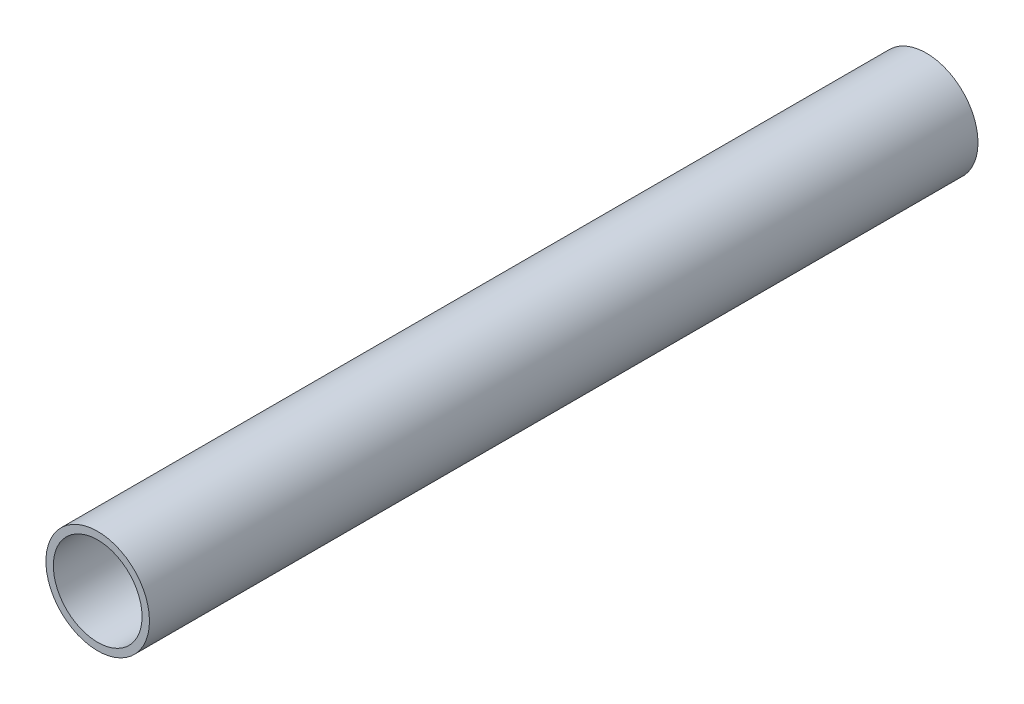
ISO-10303-21;
HEADER;
FILE_DESCRIPTION(('STEP AP214'),'2;1');
FILE_NAME('part.step','',(''),(''),'','','');
FILE_SCHEMA(('AUTOMOTIVE_DESIGN { 1 0 10303 214 1 1 1 1 }'));
ENDSEC;
DATA;
#1=APPLICATION_CONTEXT('core data for automotive mechanical design processes');
#2=APPLICATION_PROTOCOL_DEFINITION('international standard','automotive_design',2000,#1);
#3=PRODUCT_CONTEXT('',#1,'mechanical');
#4=PRODUCT('Part','Part','',(#3));
#5=PRODUCT_RELATED_PRODUCT_CATEGORY('part','',(#4));
#6=PRODUCT_DEFINITION_FORMATION('','',#4);
#7=PRODUCT_DEFINITION_CONTEXT('part definition',#1,'design');
#8=PRODUCT_DEFINITION('design','',#6,#7);
#9=PRODUCT_DEFINITION_SHAPE('','',#8);
#10=(LENGTH_UNIT() NAMED_UNIT(*) SI_UNIT(.MILLI.,.METRE.));
#11=(NAMED_UNIT(*) PLANE_ANGLE_UNIT() SI_UNIT($,.RADIAN.));
#12=(NAMED_UNIT(*) SI_UNIT($,.STERADIAN.) SOLID_ANGLE_UNIT());
#13=UNCERTAINTY_MEASURE_WITH_UNIT(LENGTH_MEASURE(1.E-05),#10,'distance_accuracy_value','');
#14=(GEOMETRIC_REPRESENTATION_CONTEXT(3) GLOBAL_UNCERTAINTY_ASSIGNED_CONTEXT((#13)) GLOBAL_UNIT_ASSIGNED_CONTEXT((#10,
#11,#12)) REPRESENTATION_CONTEXT('',''));
#15=CARTESIAN_POINT('',(0.,0.,0.));
#16=DIRECTION('',(0.,0.,1.));
#17=DIRECTION('',(1.,0.,0.));
#18=AXIS2_PLACEMENT_3D('',#15,#16,#17);
#19=CARTESIAN_POINT('',(0.,0.,50.8));
#20=DIRECTION('',(0.,0.,-1.));
#21=DIRECTION('',(-1.,0.,0.));
#22=AXIS2_PLACEMENT_3D('',#19,#20,#21);
#23=CYLINDRICAL_SURFACE('',#22,3.175);
#24=CARTESIAN_POINT('',(0.,0.,50.8));
#25=DIRECTION('',(0.,0.,1.));
#26=DIRECTION('',(1.,0.,0.));
#27=AXIS2_PLACEMENT_3D('',#24,#25,#26);
#28=CIRCLE('',#27,3.175);
#29=CARTESIAN_POINT('',(3.175,0.,50.8));
#30=VERTEX_POINT('',#29);
#31=EDGE_CURVE('E10',#30,#30,#28,.T.);
#32=ORIENTED_EDGE('',*,*,#31,.F.);
#33=EDGE_LOOP('',(#32));
#34=FACE_BOUND('',#33,.T.);
#35=CARTESIAN_POINT('',(0.,0.,0.));
#36=DIRECTION('',(0.,0.,1.));
#37=DIRECTION('',(1.,0.,0.));
#38=AXIS2_PLACEMENT_3D('',#35,#36,#37);
#39=CIRCLE('',#38,3.175);
#40=CARTESIAN_POINT('',(3.175,0.,0.));
#41=VERTEX_POINT('',#40);
#42=EDGE_CURVE('E34',#41,#41,#39,.T.);
#43=ORIENTED_EDGE('',*,*,#42,.T.);
#44=EDGE_LOOP('',(#43));
#45=FACE_BOUND('',#44,.T.);
#46=ADVANCED_FACE('F31',(#34,#45),#23,.T.);
#47=CARTESIAN_POINT('',(0.,0.,50.8));
#48=DIRECTION('',(0.,0.,1.));
#49=DIRECTION('',(1.,0.,0.));
#50=AXIS2_PLACEMENT_3D('',#47,#48,#49);
#51=PLANE('',#50);
#52=CARTESIAN_POINT('',(0.,0.,50.8));
#53=DIRECTION('',(0.,0.,1.));
#54=DIRECTION('',(1.,0.,0.));
#55=AXIS2_PLACEMENT_3D('',#52,#53,#54);
#56=CIRCLE('',#55,2.72019511079504);
#57=CARTESIAN_POINT('',(2.72019511079504,0.,50.8));
#58=VERTEX_POINT('',#57);
#59=EDGE_CURVE('E43',#58,#58,#56,.T.);
#60=ORIENTED_EDGE('',*,*,#59,.F.);
#61=EDGE_LOOP('',(#60));
#62=FACE_BOUND('',#61,.T.);
#63=ORIENTED_EDGE('',*,*,#31,.T.);
#64=EDGE_LOOP('',(#63));
#65=FACE_BOUND('',#64,.T.);
#66=ADVANCED_FACE('F58',(#62,#65),#51,.T.);
#67=CARTESIAN_POINT('',(0.,0.,0.));
#68=DIRECTION('',(0.,0.,1.));
#69=DIRECTION('',(1.,0.,0.));
#70=AXIS2_PLACEMENT_3D('',#67,#68,#69);
#71=PLANE('',#70);
#72=CARTESIAN_POINT('',(0.,0.,0.));
#73=DIRECTION('',(0.,0.,1.));
#74=DIRECTION('',(1.,0.,0.));
#75=AXIS2_PLACEMENT_3D('',#72,#73,#74);
#76=CIRCLE('',#75,2.72019511079504);
#77=CARTESIAN_POINT('',(2.72019511079504,0.,0.));
#78=VERTEX_POINT('',#77);
#79=EDGE_CURVE('E41',#78,#78,#76,.T.);
#80=ORIENTED_EDGE('',*,*,#79,.T.);
#81=EDGE_LOOP('',(#80));
#82=FACE_BOUND('',#81,.T.);
#83=ORIENTED_EDGE('',*,*,#42,.F.);
#84=EDGE_LOOP('',(#83));
#85=FACE_BOUND('',#84,.T.);
#86=ADVANCED_FACE('F49',(#82,#85),#71,.F.);
#87=CARTESIAN_POINT('',(0.,0.,0.));
#88=DIRECTION('',(0.,0.,1.));
#89=DIRECTION('',(1.,0.,0.));
#90=AXIS2_PLACEMENT_3D('',#87,#88,#89);
#91=CYLINDRICAL_SURFACE('',#90,2.72019511079504);
#92=ORIENTED_EDGE('',*,*,#79,.F.);
#93=EDGE_LOOP('',(#92));
#94=FACE_BOUND('',#93,.T.);
#95=ORIENTED_EDGE('',*,*,#59,.T.);
#96=EDGE_LOOP('',(#95));
#97=FACE_BOUND('',#96,.T.);
#98=ADVANCED_FACE('F52',(#94,#97),#91,.F.);
#99=CLOSED_SHELL('',(#46,#66,#86,#98));
#100=MANIFOLD_SOLID_BREP('B2',#99);
#101=ADVANCED_BREP_SHAPE_REPRESENTATION('',(#18,#100),#14);
#102=SHAPE_DEFINITION_REPRESENTATION(#9,#101);
ENDSEC;
END-ISO-10303-21;
